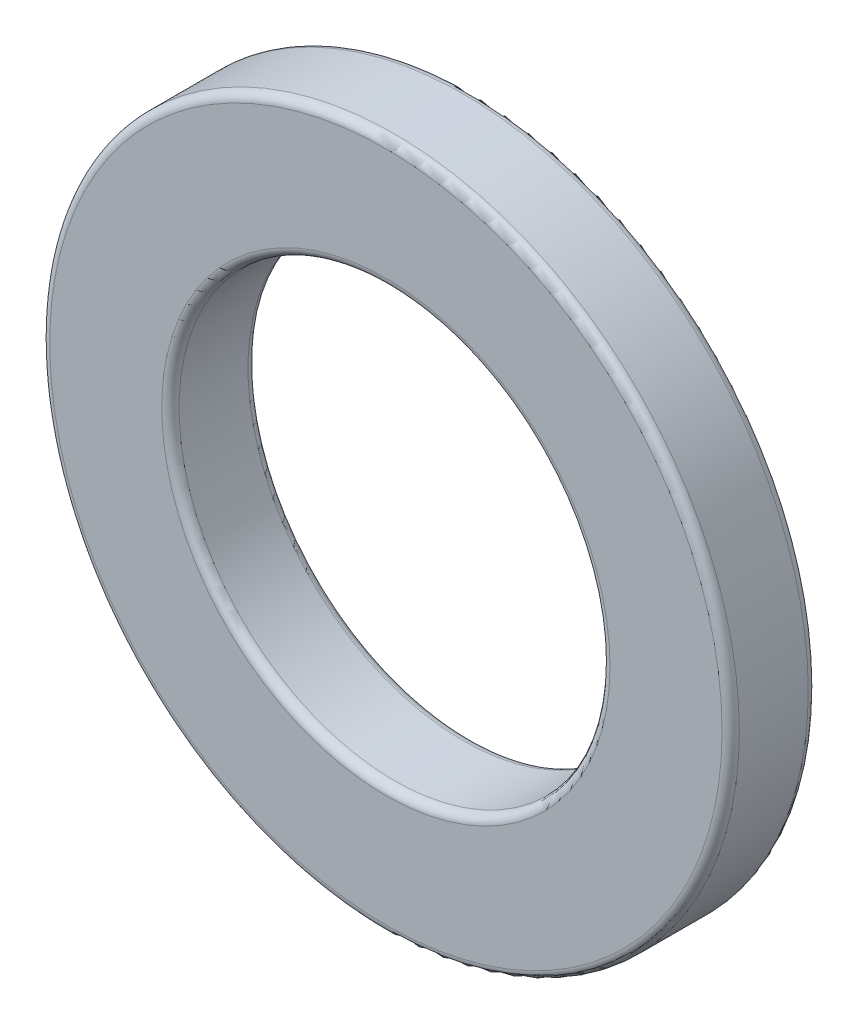
ISO-10303-21;
HEADER;
FILE_DESCRIPTION(('STEP AP214'),'2;1');
FILE_NAME('part.step','',(''),(''),'','','');
FILE_SCHEMA(('AUTOMOTIVE_DESIGN { 1 0 10303 214 1 1 1 1 }'));
ENDSEC;
DATA;
#1=APPLICATION_CONTEXT('core data for automotive mechanical design processes');
#2=APPLICATION_PROTOCOL_DEFINITION('international standard','automotive_design',2000,#1);
#3=PRODUCT_CONTEXT('',#1,'mechanical');
#4=PRODUCT('Part','Part','',(#3));
#5=PRODUCT_RELATED_PRODUCT_CATEGORY('part','',(#4));
#6=PRODUCT_DEFINITION_FORMATION('','',#4);
#7=PRODUCT_DEFINITION_CONTEXT('part definition',#1,'design');
#8=PRODUCT_DEFINITION('design','',#6,#7);
#9=PRODUCT_DEFINITION_SHAPE('','',#8);
#10=(LENGTH_UNIT() NAMED_UNIT(*) SI_UNIT(.MILLI.,.METRE.));
#11=(NAMED_UNIT(*) PLANE_ANGLE_UNIT() SI_UNIT($,.RADIAN.));
#12=(NAMED_UNIT(*) SI_UNIT($,.STERADIAN.) SOLID_ANGLE_UNIT());
#13=UNCERTAINTY_MEASURE_WITH_UNIT(LENGTH_MEASURE(1.E-05),#10,'distance_accuracy_value','');
#14=(GEOMETRIC_REPRESENTATION_CONTEXT(3) GLOBAL_UNCERTAINTY_ASSIGNED_CONTEXT((#13)) GLOBAL_UNIT_ASSIGNED_CONTEXT((#10,
#11,#12)) REPRESENTATION_CONTEXT('',''));
#15=CARTESIAN_POINT('',(0.,0.,0.));
#16=DIRECTION('',(0.,0.,1.));
#17=DIRECTION('',(1.,0.,0.));
#18=AXIS2_PLACEMENT_3D('',#15,#16,#17);
#19=CARTESIAN_POINT('',(0.,0.,1.));
#20=DIRECTION('',(0.,0.,1.));
#21=DIRECTION('',(1.,0.,0.));
#22=AXIS2_PLACEMENT_3D('',#19,#20,#21);
#23=PLANE('',#22);
#24=CARTESIAN_POINT('',(0.,0.,1.));
#25=DIRECTION('',(0.,0.,1.));
#26=DIRECTION('',(1.,0.,0.));
#27=AXIS2_PLACEMENT_3D('',#24,#25,#26);
#28=CIRCLE('',#27,2.6);
#29=CARTESIAN_POINT('',(2.6,0.,1.));
#30=VERTEX_POINT('',#29);
#31=EDGE_CURVE('E10',#30,#30,#28,.F.);
#32=ORIENTED_EDGE('',*,*,#31,.T.);
#33=EDGE_LOOP('',(#32));
#34=FACE_BOUND('',#33,.T.);
#35=CARTESIAN_POINT('',(0.,0.,1.));
#36=DIRECTION('',(0.,0.,1.));
#37=DIRECTION('',(1.,0.,0.));
#38=AXIS2_PLACEMENT_3D('',#35,#36,#37);
#39=CIRCLE('',#38,3.9);
#40=CARTESIAN_POINT('',(3.9,0.,1.));
#41=VERTEX_POINT('',#40);
#42=EDGE_CURVE('E45',#41,#41,#39,.T.);
#43=ORIENTED_EDGE('',*,*,#42,.T.);
#44=EDGE_LOOP('',(#43));
#45=FACE_BOUND('',#44,.T.);
#46=ADVANCED_FACE('F37',(#34,#45),#23,.T.);
#47=CARTESIAN_POINT('',(0.,0.,0.));
#48=DIRECTION('',(0.,0.,1.));
#49=DIRECTION('',(1.,0.,0.));
#50=AXIS2_PLACEMENT_3D('',#47,#48,#49);
#51=PLANE('',#50);
#52=CARTESIAN_POINT('',(0.,0.,0.));
#53=DIRECTION('',(0.,0.,1.));
#54=DIRECTION('',(1.,0.,0.));
#55=AXIS2_PLACEMENT_3D('',#52,#53,#54);
#56=CIRCLE('',#55,2.6);
#57=CARTESIAN_POINT('',(2.6,0.,0.));
#58=VERTEX_POINT('',#57);
#59=EDGE_CURVE('E69',#58,#58,#56,.T.);
#60=ORIENTED_EDGE('',*,*,#59,.T.);
#61=EDGE_LOOP('',(#60));
#62=FACE_BOUND('',#61,.T.);
#63=CARTESIAN_POINT('',(0.,0.,0.));
#64=DIRECTION('',(0.,0.,1.));
#65=DIRECTION('',(1.,0.,0.));
#66=AXIS2_PLACEMENT_3D('',#63,#64,#65);
#67=CIRCLE('',#66,3.9);
#68=CARTESIAN_POINT('',(3.9,0.,0.));
#69=VERTEX_POINT('',#68);
#70=EDGE_CURVE('E73',#69,#69,#67,.F.);
#71=ORIENTED_EDGE('',*,*,#70,.T.);
#72=EDGE_LOOP('',(#71));
#73=FACE_BOUND('',#72,.T.);
#74=ADVANCED_FACE('F78',(#62,#73),#51,.F.);
#75=CARTESIAN_POINT('',(0.,0.,1.));
#76=DIRECTION('',(0.,0.,-1.));
#77=DIRECTION('',(-1.,0.,0.));
#78=AXIS2_PLACEMENT_3D('',#75,#76,#77);
#79=CYLINDRICAL_SURFACE('',#78,4.);
#80=CARTESIAN_POINT('',(0.,0.,0.1));
#81=DIRECTION('',(0.,0.,1.));
#82=DIRECTION('',(1.,0.,0.));
#83=AXIS2_PLACEMENT_3D('',#80,#81,#82);
#84=CIRCLE('',#83,4.);
#85=CARTESIAN_POINT('',(4.,0.,0.1));
#86=VERTEX_POINT('',#85);
#87=EDGE_CURVE('E50',#86,#86,#84,.T.);
#88=ORIENTED_EDGE('',*,*,#87,.T.);
#89=EDGE_LOOP('',(#88));
#90=FACE_BOUND('',#89,.T.);
#91=CARTESIAN_POINT('',(0.,0.,0.9));
#92=DIRECTION('',(0.,0.,1.));
#93=DIRECTION('',(1.,0.,0.));
#94=AXIS2_PLACEMENT_3D('',#91,#92,#93);
#95=CIRCLE('',#94,4.);
#96=CARTESIAN_POINT('',(4.,0.,0.9));
#97=VERTEX_POINT('',#96);
#98=EDGE_CURVE('E55',#97,#97,#95,.F.);
#99=ORIENTED_EDGE('',*,*,#98,.T.);
#100=EDGE_LOOP('',(#99));
#101=FACE_BOUND('',#100,.T.);
#102=ADVANCED_FACE('F88',(#90,#101),#79,.T.);
#103=CARTESIAN_POINT('',(0.,0.,1.));
#104=DIRECTION('',(0.,0.,-1.));
#105=DIRECTION('',(-1.,0.,0.));
#106=AXIS2_PLACEMENT_3D('',#103,#104,#105);
#107=CYLINDRICAL_SURFACE('',#106,2.5);
#108=CARTESIAN_POINT('',(0.,0.,0.1));
#109=DIRECTION('',(0.,0.,1.));
#110=DIRECTION('',(1.,0.,0.));
#111=AXIS2_PLACEMENT_3D('',#108,#109,#110);
#112=CIRCLE('',#111,2.5);
#113=CARTESIAN_POINT('',(2.5,0.,0.1));
#114=VERTEX_POINT('',#113);
#115=EDGE_CURVE('E61',#114,#114,#112,.F.);
#116=ORIENTED_EDGE('',*,*,#115,.T.);
#117=EDGE_LOOP('',(#116));
#118=FACE_BOUND('',#117,.T.);
#119=CARTESIAN_POINT('',(0.,0.,0.9));
#120=DIRECTION('',(0.,0.,1.));
#121=DIRECTION('',(1.,0.,0.));
#122=AXIS2_PLACEMENT_3D('',#119,#120,#121);
#123=CIRCLE('',#122,2.5);
#124=CARTESIAN_POINT('',(2.5,0.,0.9));
#125=VERTEX_POINT('',#124);
#126=EDGE_CURVE('E65',#125,#125,#123,.T.);
#127=ORIENTED_EDGE('',*,*,#126,.T.);
#128=EDGE_LOOP('',(#127));
#129=FACE_BOUND('',#128,.T.);
#130=ADVANCED_FACE('F91',(#118,#129),#107,.F.);
#131=CARTESIAN_POINT('',(0.,0.,0.1));
#132=DIRECTION('',(0.,0.,1.));
#133=DIRECTION('',(1.,0.,0.));
#134=AXIS2_PLACEMENT_3D('',#131,#132,#133);
#135=TOROIDAL_SURFACE('',#134,2.6,0.1);
#136=ORIENTED_EDGE('',*,*,#115,.F.);
#137=EDGE_LOOP('',(#136));
#138=FACE_BOUND('',#137,.T.);
#139=ORIENTED_EDGE('',*,*,#59,.F.);
#140=EDGE_LOOP('',(#139));
#141=FACE_BOUND('',#140,.T.);
#142=ADVANCED_FACE('F84',(#138,#141),#135,.T.);
#143=CARTESIAN_POINT('',(0.,0.,0.1));
#144=DIRECTION('',(0.,0.,1.));
#145=DIRECTION('',(1.,0.,0.));
#146=AXIS2_PLACEMENT_3D('',#143,#144,#145);
#147=TOROIDAL_SURFACE('',#146,3.9,0.1);
#148=ORIENTED_EDGE('',*,*,#70,.F.);
#149=EDGE_LOOP('',(#148));
#150=FACE_BOUND('',#149,.T.);
#151=ORIENTED_EDGE('',*,*,#87,.F.);
#152=EDGE_LOOP('',(#151));
#153=FACE_BOUND('',#152,.T.);
#154=ADVANCED_FACE('F80',(#150,#153),#147,.T.);
#155=CARTESIAN_POINT('',(0.,0.,0.9));
#156=DIRECTION('',(0.,0.,1.));
#157=DIRECTION('',(1.,0.,0.));
#158=AXIS2_PLACEMENT_3D('',#155,#156,#157);
#159=TOROIDAL_SURFACE('',#158,2.6,0.1);
#160=ORIENTED_EDGE('',*,*,#31,.F.);
#161=EDGE_LOOP('',(#160));
#162=FACE_BOUND('',#161,.T.);
#163=ORIENTED_EDGE('',*,*,#126,.F.);
#164=EDGE_LOOP('',(#163));
#165=FACE_BOUND('',#164,.T.);
#166=ADVANCED_FACE('F83',(#162,#165),#159,.T.);
#167=CARTESIAN_POINT('',(0.,0.,0.9));
#168=DIRECTION('',(0.,0.,1.));
#169=DIRECTION('',(1.,0.,0.));
#170=AXIS2_PLACEMENT_3D('',#167,#168,#169);
#171=TOROIDAL_SURFACE('',#170,3.9,0.1);
#172=ORIENTED_EDGE('',*,*,#98,.F.);
#173=EDGE_LOOP('',(#172));
#174=FACE_BOUND('',#173,.T.);
#175=ORIENTED_EDGE('',*,*,#42,.F.);
#176=EDGE_LOOP('',(#175));
#177=FACE_BOUND('',#176,.T.);
#178=ADVANCED_FACE('F39',(#174,#177),#171,.T.);
#179=CLOSED_SHELL('',(#46,#74,#102,#130,#142,#154,#166,#178));
#180=MANIFOLD_SOLID_BREP('B2',#179);
#181=ADVANCED_BREP_SHAPE_REPRESENTATION('',(#18,#180),#14);
#182=SHAPE_DEFINITION_REPRESENTATION(#9,#181);
ENDSEC;
END-ISO-10303-21;
